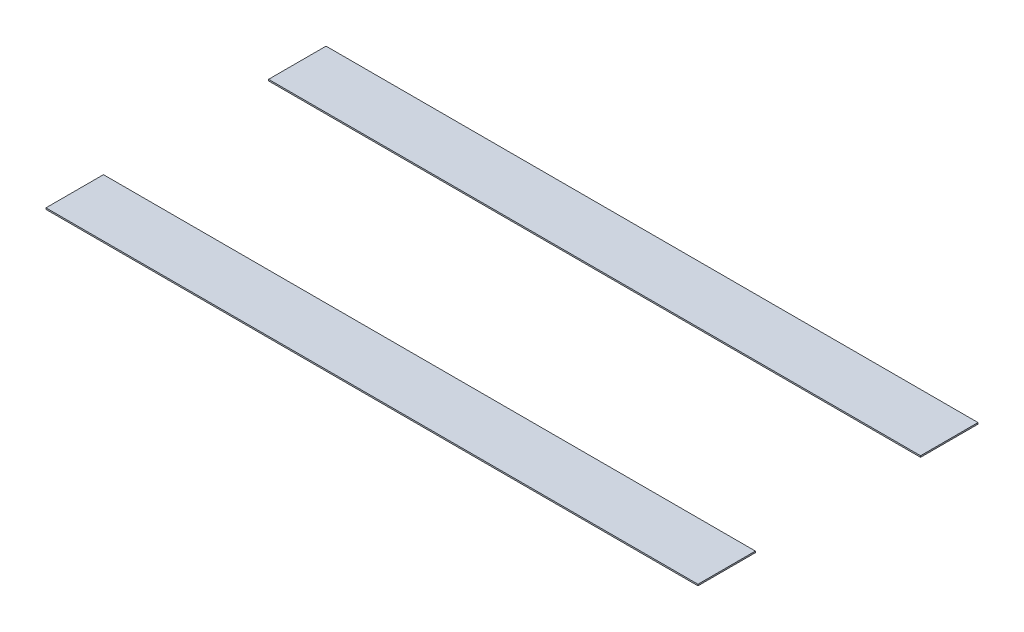
ISO-10303-21;
HEADER;
FILE_DESCRIPTION(('STEP AP214'),'2;1');
FILE_NAME('part.step','',(''),(''),'','','');
FILE_SCHEMA(('AUTOMOTIVE_DESIGN { 1 0 10303 214 1 1 1 1 }'));
ENDSEC;
DATA;
#1=APPLICATION_CONTEXT('core data for automotive mechanical design processes');
#2=APPLICATION_PROTOCOL_DEFINITION('international standard','automotive_design',2000,#1);
#3=PRODUCT_CONTEXT('',#1,'mechanical');
#4=PRODUCT('Part','Part','',(#3));
#5=PRODUCT_RELATED_PRODUCT_CATEGORY('part','',(#4));
#6=PRODUCT_DEFINITION_FORMATION('','',#4);
#7=PRODUCT_DEFINITION_CONTEXT('part definition',#1,'design');
#8=PRODUCT_DEFINITION('design','',#6,#7);
#9=PRODUCT_DEFINITION_SHAPE('','',#8);
#10=(LENGTH_UNIT() NAMED_UNIT(*) SI_UNIT(.MILLI.,.METRE.));
#11=(NAMED_UNIT(*) PLANE_ANGLE_UNIT() SI_UNIT($,.RADIAN.));
#12=(NAMED_UNIT(*) SI_UNIT($,.STERADIAN.) SOLID_ANGLE_UNIT());
#13=UNCERTAINTY_MEASURE_WITH_UNIT(LENGTH_MEASURE(1.E-05),#10,'distance_accuracy_value','');
#14=(GEOMETRIC_REPRESENTATION_CONTEXT(3) GLOBAL_UNCERTAINTY_ASSIGNED_CONTEXT((#13)) GLOBAL_UNIT_ASSIGNED_CONTEXT((#10,
#11,#12)) REPRESENTATION_CONTEXT('',''));
#15=CARTESIAN_POINT('',(0.,0.,0.));
#16=DIRECTION('',(0.,0.,1.));
#17=DIRECTION('',(1.,0.,0.));
#18=AXIS2_PLACEMENT_3D('',#15,#16,#17);
#19=CARTESIAN_POINT('',(-2270.,60.,975.));
#20=DIRECTION('',(0.,0.,-1.));
#21=DIRECTION('',(-1.,0.,0.));
#22=AXIS2_PLACEMENT_3D('',#19,#20,#21);
#23=PLANE('',#22);
#24=DIRECTION('',(1.,0.,0.));
#25=VECTOR('',#24,1.);
#26=CARTESIAN_POINT('',(-2270.,50.,975.));
#27=LINE('',#26,#25);
#28=CARTESIAN_POINT('',(-2270.,50.,975.));
#29=VERTEX_POINT('',#28);
#30=CARTESIAN_POINT('',(2270.,50.,975.));
#31=VERTEX_POINT('',#30);
#32=EDGE_CURVE('E107',#29,#31,#27,.T.);
#33=ORIENTED_EDGE('',*,*,#32,.T.);
#34=DIRECTION('',(0.,-1.,0.));
#35=VECTOR('',#34,1.);
#36=CARTESIAN_POINT('',(2270.,60.,975.));
#37=LINE('',#36,#35);
#38=CARTESIAN_POINT('',(2270.,60.,975.));
#39=VERTEX_POINT('',#38);
#40=EDGE_CURVE('E12',#39,#31,#37,.T.);
#41=ORIENTED_EDGE('',*,*,#40,.F.);
#42=DIRECTION('',(1.,0.,0.));
#43=VECTOR('',#42,1.);
#44=CARTESIAN_POINT('',(-2270.,60.,975.));
#45=LINE('',#44,#43);
#46=CARTESIAN_POINT('',(-2270.,60.,975.));
#47=VERTEX_POINT('',#46);
#48=EDGE_CURVE('E95',#47,#39,#45,.T.);
#49=ORIENTED_EDGE('',*,*,#48,.F.);
#50=DIRECTION('',(0.,-1.,0.));
#51=VECTOR('',#50,1.);
#52=CARTESIAN_POINT('',(-2270.,60.,975.));
#53=LINE('',#52,#51);
#54=EDGE_CURVE('E103',#47,#29,#53,.T.);
#55=ORIENTED_EDGE('',*,*,#54,.T.);
#56=EDGE_LOOP('',(#33,#41,#49,#55));
#57=FACE_BOUND('',#56,.T.);
#58=ADVANCED_FACE('F44',(#57),#23,.F.);
#59=CARTESIAN_POINT('',(2270.,60.,975.));
#60=DIRECTION('',(-1.,0.,0.));
#61=DIRECTION('',(0.,0.,1.));
#62=AXIS2_PLACEMENT_3D('',#59,#60,#61);
#63=PLANE('',#62);
#64=DIRECTION('',(0.,0.,-1.));
#65=VECTOR('',#64,1.);
#66=CARTESIAN_POINT('',(2270.,50.,975.));
#67=LINE('',#66,#65);
#68=CARTESIAN_POINT('',(2270.,50.,575.));
#69=VERTEX_POINT('',#68);
#70=EDGE_CURVE('E99',#31,#69,#67,.T.);
#71=ORIENTED_EDGE('',*,*,#70,.T.);
#72=DIRECTION('',(0.,-1.,0.));
#73=VECTOR('',#72,1.);
#74=CARTESIAN_POINT('',(2270.,60.,575.));
#75=LINE('',#74,#73);
#76=CARTESIAN_POINT('',(2270.,60.,575.));
#77=VERTEX_POINT('',#76);
#78=EDGE_CURVE('E52',#77,#69,#75,.T.);
#79=ORIENTED_EDGE('',*,*,#78,.F.);
#80=DIRECTION('',(0.,0.,-1.));
#81=VECTOR('',#80,1.);
#82=CARTESIAN_POINT('',(2270.,60.,975.));
#83=LINE('',#82,#81);
#84=EDGE_CURVE('E90',#39,#77,#83,.T.);
#85=ORIENTED_EDGE('',*,*,#84,.F.);
#86=ORIENTED_EDGE('',*,*,#40,.T.);
#87=EDGE_LOOP('',(#71,#79,#85,#86));
#88=FACE_BOUND('',#87,.T.);
#89=ADVANCED_FACE('F98',(#88),#63,.F.);
#90=CARTESIAN_POINT('',(-2270.,60.,575.));
#91=DIRECTION('',(0.,0.,1.));
#92=DIRECTION('',(1.,0.,0.));
#93=AXIS2_PLACEMENT_3D('',#90,#91,#92);
#94=PLANE('',#93);
#95=DIRECTION('',(-1.,0.,0.));
#96=VECTOR('',#95,1.);
#97=CARTESIAN_POINT('',(-2270.,50.,575.));
#98=LINE('',#97,#96);
#99=CARTESIAN_POINT('',(-2270.,50.,575.));
#100=VERTEX_POINT('',#99);
#101=EDGE_CURVE('E77',#69,#100,#98,.T.);
#102=ORIENTED_EDGE('',*,*,#101,.T.);
#103=DIRECTION('',(0.,-1.,0.));
#104=VECTOR('',#103,1.);
#105=CARTESIAN_POINT('',(-2270.,60.,575.));
#106=LINE('',#105,#104);
#107=CARTESIAN_POINT('',(-2270.,60.,575.));
#108=VERTEX_POINT('',#107);
#109=EDGE_CURVE('E100',#108,#100,#106,.T.);
#110=ORIENTED_EDGE('',*,*,#109,.F.);
#111=DIRECTION('',(-1.,0.,0.));
#112=VECTOR('',#111,1.);
#113=CARTESIAN_POINT('',(-2270.,60.,575.));
#114=LINE('',#113,#112);
#115=EDGE_CURVE('E93',#77,#108,#114,.T.);
#116=ORIENTED_EDGE('',*,*,#115,.F.);
#117=ORIENTED_EDGE('',*,*,#78,.T.);
#118=EDGE_LOOP('',(#102,#110,#116,#117));
#119=FACE_BOUND('',#118,.T.);
#120=ADVANCED_FACE('F101',(#119),#94,.F.);
#121=CARTESIAN_POINT('',(-2270.,60.,975.));
#122=DIRECTION('',(1.,0.,0.));
#123=DIRECTION('',(0.,0.,-1.));
#124=AXIS2_PLACEMENT_3D('',#121,#122,#123);
#125=PLANE('',#124);
#126=DIRECTION('',(0.,0.,1.));
#127=VECTOR('',#126,1.);
#128=CARTESIAN_POINT('',(-2270.,50.,975.));
#129=LINE('',#128,#127);
#130=EDGE_CURVE('E83',#100,#29,#129,.T.);
#131=ORIENTED_EDGE('',*,*,#130,.T.);
#132=ORIENTED_EDGE('',*,*,#54,.F.);
#133=DIRECTION('',(0.,0.,1.));
#134=VECTOR('',#133,1.);
#135=CARTESIAN_POINT('',(-2270.,60.,975.));
#136=LINE('',#135,#134);
#137=EDGE_CURVE('E60',#108,#47,#136,.T.);
#138=ORIENTED_EDGE('',*,*,#137,.F.);
#139=ORIENTED_EDGE('',*,*,#109,.T.);
#140=EDGE_LOOP('',(#131,#132,#138,#139));
#141=FACE_BOUND('',#140,.T.);
#142=ADVANCED_FACE('F114',(#141),#125,.F.);
#143=CARTESIAN_POINT('',(0.,60.,0.));
#144=DIRECTION('',(0.,1.,0.));
#145=DIRECTION('',(0.,0.,1.));
#146=AXIS2_PLACEMENT_3D('',#143,#144,#145);
#147=PLANE('',#146);
#148=ORIENTED_EDGE('',*,*,#48,.T.);
#149=ORIENTED_EDGE('',*,*,#84,.T.);
#150=ORIENTED_EDGE('',*,*,#115,.T.);
#151=ORIENTED_EDGE('',*,*,#137,.T.);
#152=EDGE_LOOP('',(#148,#149,#150,#151));
#153=FACE_BOUND('',#152,.T.);
#154=ADVANCED_FACE('F91',(#153),#147,.T.);
#155=CARTESIAN_POINT('',(0.,50.,0.));
#156=DIRECTION('',(0.,1.,0.));
#157=DIRECTION('',(0.,0.,1.));
#158=AXIS2_PLACEMENT_3D('',#155,#156,#157);
#159=PLANE('',#158);
#160=ORIENTED_EDGE('',*,*,#32,.F.);
#161=ORIENTED_EDGE('',*,*,#130,.F.);
#162=ORIENTED_EDGE('',*,*,#101,.F.);
#163=ORIENTED_EDGE('',*,*,#70,.F.);
#164=EDGE_LOOP('',(#160,#161,#162,#163));
#165=FACE_BOUND('',#164,.T.);
#166=ADVANCED_FACE('F117',(#165),#159,.F.);
#167=CLOSED_SHELL('',(#58,#89,#120,#142,#154,#166));
#168=MANIFOLD_SOLID_BREP('B2',#167);
#169=CARTESIAN_POINT('',(-2270.,60.,-975.));
#170=DIRECTION('',(1.,0.,0.));
#171=DIRECTION('',(0.,0.,-1.));
#172=AXIS2_PLACEMENT_3D('',#169,#170,#171);
#173=PLANE('',#172);
#174=DIRECTION('',(0.,0.,1.));
#175=VECTOR('',#174,1.);
#176=CARTESIAN_POINT('',(-2270.,50.,-975.));
#177=LINE('',#176,#175);
#178=CARTESIAN_POINT('',(-2270.,50.,-975.));
#179=VERTEX_POINT('',#178);
#180=CARTESIAN_POINT('',(-2270.,50.,-575.));
#181=VERTEX_POINT('',#180);
#182=EDGE_CURVE('E230',#179,#181,#177,.T.);
#183=ORIENTED_EDGE('',*,*,#182,.T.);
#184=DIRECTION('',(0.,-1.,0.));
#185=VECTOR('',#184,1.);
#186=CARTESIAN_POINT('',(-2270.,60.,-575.));
#187=LINE('',#186,#185);
#188=CARTESIAN_POINT('',(-2270.,60.,-575.));
#189=VERTEX_POINT('',#188);
#190=EDGE_CURVE('E42',#189,#181,#187,.T.);
#191=ORIENTED_EDGE('',*,*,#190,.F.);
#192=DIRECTION('',(0.,0.,1.));
#193=VECTOR('',#192,1.);
#194=CARTESIAN_POINT('',(-2270.,60.,-975.));
#195=LINE('',#194,#193);
#196=CARTESIAN_POINT('',(-2270.,60.,-975.));
#197=VERTEX_POINT('',#196);
#198=EDGE_CURVE('E218',#197,#189,#195,.T.);
#199=ORIENTED_EDGE('',*,*,#198,.F.);
#200=DIRECTION('',(0.,-1.,0.));
#201=VECTOR('',#200,1.);
#202=CARTESIAN_POINT('',(-2270.,60.,-975.));
#203=LINE('',#202,#201);
#204=EDGE_CURVE('E226',#197,#179,#203,.T.);
#205=ORIENTED_EDGE('',*,*,#204,.T.);
#206=EDGE_LOOP('',(#183,#191,#199,#205));
#207=FACE_BOUND('',#206,.T.);
#208=ADVANCED_FACE('F167',(#207),#173,.F.);
#209=CARTESIAN_POINT('',(-2270.,60.,-575.));
#210=DIRECTION('',(0.,0.,-1.));
#211=DIRECTION('',(-1.,0.,0.));
#212=AXIS2_PLACEMENT_3D('',#209,#210,#211);
#213=PLANE('',#212);
#214=DIRECTION('',(1.,0.,0.));
#215=VECTOR('',#214,1.);
#216=CARTESIAN_POINT('',(-2270.,50.,-575.));
#217=LINE('',#216,#215);
#218=CARTESIAN_POINT('',(2270.,50.,-575.));
#219=VERTEX_POINT('',#218);
#220=EDGE_CURVE('E222',#181,#219,#217,.T.);
#221=ORIENTED_EDGE('',*,*,#220,.T.);
#222=DIRECTION('',(0.,-1.,0.));
#223=VECTOR('',#222,1.);
#224=CARTESIAN_POINT('',(2270.,60.,-575.));
#225=LINE('',#224,#223);
#226=CARTESIAN_POINT('',(2270.,60.,-575.));
#227=VERTEX_POINT('',#226);
#228=EDGE_CURVE('E175',#227,#219,#225,.T.);
#229=ORIENTED_EDGE('',*,*,#228,.F.);
#230=DIRECTION('',(1.,0.,0.));
#231=VECTOR('',#230,1.);
#232=CARTESIAN_POINT('',(-2270.,60.,-575.));
#233=LINE('',#232,#231);
#234=EDGE_CURVE('E213',#189,#227,#233,.T.);
#235=ORIENTED_EDGE('',*,*,#234,.F.);
#236=ORIENTED_EDGE('',*,*,#190,.T.);
#237=EDGE_LOOP('',(#221,#229,#235,#236));
#238=FACE_BOUND('',#237,.T.);
#239=ADVANCED_FACE('F221',(#238),#213,.F.);
#240=CARTESIAN_POINT('',(2270.,60.,-975.));
#241=DIRECTION('',(-1.,0.,0.));
#242=DIRECTION('',(0.,0.,1.));
#243=AXIS2_PLACEMENT_3D('',#240,#241,#242);
#244=PLANE('',#243);
#245=DIRECTION('',(0.,0.,-1.));
#246=VECTOR('',#245,1.);
#247=CARTESIAN_POINT('',(2270.,50.,-975.));
#248=LINE('',#247,#246);
#249=CARTESIAN_POINT('',(2270.,50.,-975.));
#250=VERTEX_POINT('',#249);
#251=EDGE_CURVE('E200',#219,#250,#248,.T.);
#252=ORIENTED_EDGE('',*,*,#251,.T.);
#253=DIRECTION('',(0.,-1.,0.));
#254=VECTOR('',#253,1.);
#255=CARTESIAN_POINT('',(2270.,60.,-975.));
#256=LINE('',#255,#254);
#257=CARTESIAN_POINT('',(2270.,60.,-975.));
#258=VERTEX_POINT('',#257);
#259=EDGE_CURVE('E223',#258,#250,#256,.T.);
#260=ORIENTED_EDGE('',*,*,#259,.F.);
#261=DIRECTION('',(0.,0.,-1.));
#262=VECTOR('',#261,1.);
#263=CARTESIAN_POINT('',(2270.,60.,-975.));
#264=LINE('',#263,#262);
#265=EDGE_CURVE('E216',#227,#258,#264,.T.);
#266=ORIENTED_EDGE('',*,*,#265,.F.);
#267=ORIENTED_EDGE('',*,*,#228,.T.);
#268=EDGE_LOOP('',(#252,#260,#266,#267));
#269=FACE_BOUND('',#268,.T.);
#270=ADVANCED_FACE('F224',(#269),#244,.F.);
#271=CARTESIAN_POINT('',(-2270.,60.,-975.));
#272=DIRECTION('',(0.,0.,1.));
#273=DIRECTION('',(1.,0.,0.));
#274=AXIS2_PLACEMENT_3D('',#271,#272,#273);
#275=PLANE('',#274);
#276=DIRECTION('',(-1.,0.,0.));
#277=VECTOR('',#276,1.);
#278=CARTESIAN_POINT('',(-2270.,50.,-975.));
#279=LINE('',#278,#277);
#280=EDGE_CURVE('E206',#250,#179,#279,.T.);
#281=ORIENTED_EDGE('',*,*,#280,.T.);
#282=ORIENTED_EDGE('',*,*,#204,.F.);
#283=DIRECTION('',(-1.,0.,0.));
#284=VECTOR('',#283,1.);
#285=CARTESIAN_POINT('',(-2270.,60.,-975.));
#286=LINE('',#285,#284);
#287=EDGE_CURVE('E183',#258,#197,#286,.T.);
#288=ORIENTED_EDGE('',*,*,#287,.F.);
#289=ORIENTED_EDGE('',*,*,#259,.T.);
#290=EDGE_LOOP('',(#281,#282,#288,#289));
#291=FACE_BOUND('',#290,.T.);
#292=ADVANCED_FACE('F237',(#291),#275,.F.);
#293=CARTESIAN_POINT('',(0.,60.,0.));
#294=DIRECTION('',(0.,1.,0.));
#295=DIRECTION('',(0.,0.,1.));
#296=AXIS2_PLACEMENT_3D('',#293,#294,#295);
#297=PLANE('',#296);
#298=ORIENTED_EDGE('',*,*,#198,.T.);
#299=ORIENTED_EDGE('',*,*,#234,.T.);
#300=ORIENTED_EDGE('',*,*,#265,.T.);
#301=ORIENTED_EDGE('',*,*,#287,.T.);
#302=EDGE_LOOP('',(#298,#299,#300,#301));
#303=FACE_BOUND('',#302,.T.);
#304=ADVANCED_FACE('F214',(#303),#297,.T.);
#305=CARTESIAN_POINT('',(0.,50.,0.));
#306=DIRECTION('',(0.,1.,0.));
#307=DIRECTION('',(0.,0.,1.));
#308=AXIS2_PLACEMENT_3D('',#305,#306,#307);
#309=PLANE('',#308);
#310=ORIENTED_EDGE('',*,*,#182,.F.);
#311=ORIENTED_EDGE('',*,*,#280,.F.);
#312=ORIENTED_EDGE('',*,*,#251,.F.);
#313=ORIENTED_EDGE('',*,*,#220,.F.);
#314=EDGE_LOOP('',(#310,#311,#312,#313));
#315=FACE_BOUND('',#314,.T.);
#316=ADVANCED_FACE('F240',(#315),#309,.F.);
#317=CLOSED_SHELL('',(#208,#239,#270,#292,#304,#316));
#318=MANIFOLD_SOLID_BREP('B6',#317);
#319=ADVANCED_BREP_SHAPE_REPRESENTATION('',(#18,#168,#318),#14);
#320=SHAPE_DEFINITION_REPRESENTATION(#9,#319);
ENDSEC;
END-ISO-10303-21;
